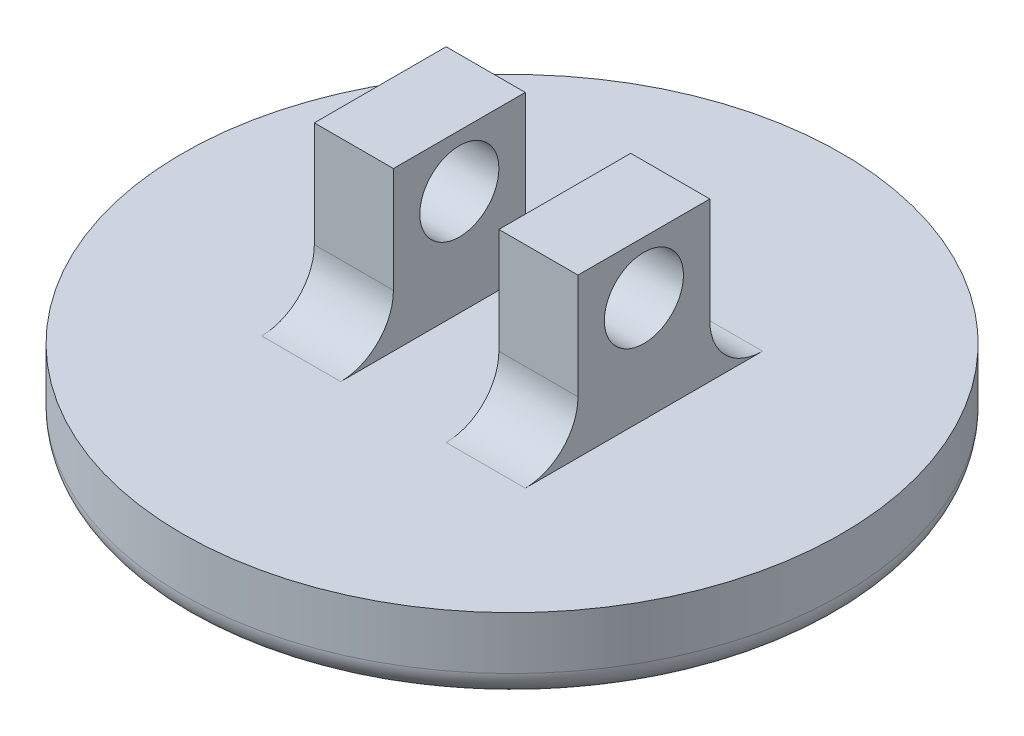
ISO-10303-21;
HEADER;
FILE_DESCRIPTION(('STEP AP214'),'2;1');
FILE_NAME('part.step','',(''),(''),'','','');
FILE_SCHEMA(('AUTOMOTIVE_DESIGN { 1 0 10303 214 1 1 1 1 }'));
ENDSEC;
DATA;
#1=APPLICATION_CONTEXT('core data for automotive mechanical design processes');
#2=APPLICATION_PROTOCOL_DEFINITION('international standard','automotive_design',2000,#1);
#3=PRODUCT_CONTEXT('',#1,'mechanical');
#4=PRODUCT('Part','Part','',(#3));
#5=PRODUCT_RELATED_PRODUCT_CATEGORY('part','',(#4));
#6=PRODUCT_DEFINITION_FORMATION('','',#4);
#7=PRODUCT_DEFINITION_CONTEXT('part definition',#1,'design');
#8=PRODUCT_DEFINITION('design','',#6,#7);
#9=PRODUCT_DEFINITION_SHAPE('','',#8);
#10=(LENGTH_UNIT() NAMED_UNIT(*) SI_UNIT(.MILLI.,.METRE.));
#11=(NAMED_UNIT(*) PLANE_ANGLE_UNIT() SI_UNIT($,.RADIAN.));
#12=(NAMED_UNIT(*) SI_UNIT($,.STERADIAN.) SOLID_ANGLE_UNIT());
#13=UNCERTAINTY_MEASURE_WITH_UNIT(LENGTH_MEASURE(1.E-05),#10,'distance_accuracy_value','');
#14=(GEOMETRIC_REPRESENTATION_CONTEXT(3) GLOBAL_UNCERTAINTY_ASSIGNED_CONTEXT((#13)) GLOBAL_UNIT_ASSIGNED_CONTEXT((#10,
#11,#12)) REPRESENTATION_CONTEXT('',''));
#15=CARTESIAN_POINT('',(0.,0.,0.));
#16=DIRECTION('',(0.,0.,1.));
#17=DIRECTION('',(1.,0.,0.));
#18=AXIS2_PLACEMENT_3D('',#15,#16,#17);
#19=CARTESIAN_POINT('',(0.,3.,0.));
#20=DIRECTION('',(0.,1.,0.));
#21=DIRECTION('',(0.,0.,1.));
#22=AXIS2_PLACEMENT_3D('',#19,#20,#21);
#23=PLANE('',#22);
#24=CARTESIAN_POINT('',(0.,3.,0.));
#25=DIRECTION('',(0.,1.,0.));
#26=DIRECTION('',(0.,0.,1.));
#27=AXIS2_PLACEMENT_3D('',#24,#25,#26);
#28=CIRCLE('',#27,12.5);
#29=CARTESIAN_POINT('',(0.,3.,12.5));
#30=VERTEX_POINT('',#29);
#31=EDGE_CURVE('E181',#30,#30,#28,.T.);
#32=ORIENTED_EDGE('',*,*,#31,.T.);
#33=EDGE_LOOP('',(#32));
#34=FACE_BOUND('',#33,.T.);
#35=DIRECTION('',(0.,0.,-1.));
#36=VECTOR('',#35,1.);
#37=CARTESIAN_POINT('',(-2.,3.,-2.5));
#38=LINE('',#37,#36);
#39=CARTESIAN_POINT('',(-2.,3.,4.5));
#40=VERTEX_POINT('',#39);
#41=CARTESIAN_POINT('',(-2.,3.,-4.5));
#42=VERTEX_POINT('',#41);
#43=EDGE_CURVE('E151',#40,#42,#38,.T.);
#44=ORIENTED_EDGE('',*,*,#43,.F.);
#45=DIRECTION('',(1.,0.,0.));
#46=VECTOR('',#45,1.);
#47=CARTESIAN_POINT('',(0.,3.,4.5));
#48=LINE('',#47,#46);
#49=CARTESIAN_POINT('',(-5.,3.,4.5));
#50=VERTEX_POINT('',#49);
#51=EDGE_CURVE('E200',#40,#50,#48,.F.);
#52=ORIENTED_EDGE('',*,*,#51,.T.);
#53=DIRECTION('',(0.,0.,1.));
#54=VECTOR('',#53,1.);
#55=CARTESIAN_POINT('',(-5.,3.,-2.5));
#56=LINE('',#55,#54);
#57=CARTESIAN_POINT('',(-5.,3.,-4.5));
#58=VERTEX_POINT('',#57);
#59=EDGE_CURVE('E153',#58,#50,#56,.T.);
#60=ORIENTED_EDGE('',*,*,#59,.F.);
#61=DIRECTION('',(-1.,0.,0.));
#62=VECTOR('',#61,1.);
#63=CARTESIAN_POINT('',(0.,3.,-4.5));
#64=LINE('',#63,#62);
#65=EDGE_CURVE('E197',#58,#42,#64,.F.);
#66=ORIENTED_EDGE('',*,*,#65,.T.);
#67=EDGE_LOOP('',(#44,#52,#60,#66));
#68=FACE_BOUND('',#67,.T.);
#69=DIRECTION('',(0.,0.,1.));
#70=VECTOR('',#69,1.);
#71=CARTESIAN_POINT('',(2.,3.,-2.5));
#72=LINE('',#71,#70);
#73=CARTESIAN_POINT('',(2.,3.,-4.5));
#74=VERTEX_POINT('',#73);
#75=CARTESIAN_POINT('',(2.,3.,4.5));
#76=VERTEX_POINT('',#75);
#77=EDGE_CURVE('E146',#74,#76,#72,.T.);
#78=ORIENTED_EDGE('',*,*,#77,.F.);
#79=DIRECTION('',(-1.,0.,0.));
#80=VECTOR('',#79,1.);
#81=CARTESIAN_POINT('',(0.,3.,-4.5));
#82=LINE('',#81,#80);
#83=CARTESIAN_POINT('',(5.,3.,-4.5));
#84=VERTEX_POINT('',#83);
#85=EDGE_CURVE('E194',#74,#84,#82,.F.);
#86=ORIENTED_EDGE('',*,*,#85,.T.);
#87=DIRECTION('',(0.,0.,-1.));
#88=VECTOR('',#87,1.);
#89=CARTESIAN_POINT('',(5.,3.,-2.5));
#90=LINE('',#89,#88);
#91=CARTESIAN_POINT('',(5.,3.,4.5));
#92=VERTEX_POINT('',#91);
#93=EDGE_CURVE('E274',#92,#84,#90,.T.);
#94=ORIENTED_EDGE('',*,*,#93,.F.);
#95=DIRECTION('',(1.,0.,0.));
#96=VECTOR('',#95,1.);
#97=CARTESIAN_POINT('',(0.,3.,4.5));
#98=LINE('',#97,#96);
#99=EDGE_CURVE('E191',#92,#76,#98,.F.);
#100=ORIENTED_EDGE('',*,*,#99,.T.);
#101=EDGE_LOOP('',(#78,#86,#94,#100));
#102=FACE_BOUND('',#101,.T.);
#103=ADVANCED_FACE('F33',(#34,#68,#102),#23,.T.);
#104=CARTESIAN_POINT('',(0.,3.,0.));
#105=DIRECTION('',(0.,-1.,0.));
#106=DIRECTION('',(0.,0.,-1.));
#107=AXIS2_PLACEMENT_3D('',#104,#105,#106);
#108=CYLINDRICAL_SURFACE('',#107,12.5);
#109=CARTESIAN_POINT('',(0.,1.,0.));
#110=DIRECTION('',(0.,1.,0.));
#111=DIRECTION('',(0.,0.,1.));
#112=AXIS2_PLACEMENT_3D('',#109,#110,#111);
#113=CIRCLE('',#112,12.5);
#114=CARTESIAN_POINT('',(0.,1.,12.5));
#115=VERTEX_POINT('',#114);
#116=EDGE_CURVE('E41',#115,#115,#113,.T.);
#117=ORIENTED_EDGE('',*,*,#116,.T.);
#118=EDGE_LOOP('',(#117));
#119=FACE_BOUND('',#118,.T.);
#120=ORIENTED_EDGE('',*,*,#31,.F.);
#121=EDGE_LOOP('',(#120));
#122=FACE_BOUND('',#121,.T.);
#123=ADVANCED_FACE('F228',(#119,#122),#108,.T.);
#124=CARTESIAN_POINT('',(0.,0.,0.));
#125=DIRECTION('',(0.,1.,0.));
#126=DIRECTION('',(0.,0.,1.));
#127=AXIS2_PLACEMENT_3D('',#124,#125,#126);
#128=PLANE('',#127);
#129=CARTESIAN_POINT('',(0.,0.,0.));
#130=DIRECTION('',(0.,1.,0.));
#131=DIRECTION('',(0.,0.,1.));
#132=AXIS2_PLACEMENT_3D('',#129,#130,#131);
#133=CIRCLE('',#132,11.5);
#134=CARTESIAN_POINT('',(0.,0.,11.5));
#135=VERTEX_POINT('',#134);
#136=EDGE_CURVE('E11',#135,#135,#133,.F.);
#137=ORIENTED_EDGE('',*,*,#136,.T.);
#138=EDGE_LOOP('',(#137));
#139=FACE_BOUND('',#138,.T.);
#140=ADVANCED_FACE('F245',(#139),#128,.F.);
#141=CARTESIAN_POINT('',(-2.,9.,-2.5));
#142=DIRECTION('',(-1.,0.,0.));
#143=DIRECTION('',(0.,0.,1.));
#144=AXIS2_PLACEMENT_3D('',#141,#142,#143);
#145=PLANE('',#144);
#146=CARTESIAN_POINT('',(-2.,7.,0.));
#147=DIRECTION('',(-1.,0.,0.));
#148=DIRECTION('',(0.,0.,1.));
#149=AXIS2_PLACEMENT_3D('',#146,#147,#148);
#150=CIRCLE('',#149,1.5);
#151=CARTESIAN_POINT('',(-2.,7.,1.5));
#152=VERTEX_POINT('',#151);
#153=EDGE_CURVE('E276',#152,#152,#150,.T.);
#154=ORIENTED_EDGE('',*,*,#153,.T.);
#155=EDGE_LOOP('',(#154));
#156=FACE_BOUND('',#155,.T.);
#157=ORIENTED_EDGE('',*,*,#43,.T.);
#158=CARTESIAN_POINT('',(-2.,5.,-4.5));
#159=DIRECTION('',(-1.,0.,0.));
#160=DIRECTION('',(0.,0.,1.));
#161=AXIS2_PLACEMENT_3D('',#158,#159,#160);
#162=CIRCLE('',#161,2.);
#163=CARTESIAN_POINT('',(-2.,5.,-2.5));
#164=VERTEX_POINT('',#163);
#165=EDGE_CURVE('E218',#42,#164,#162,.T.);
#166=ORIENTED_EDGE('',*,*,#165,.T.);
#167=DIRECTION('',(0.,-1.,0.));
#168=VECTOR('',#167,1.);
#169=CARTESIAN_POINT('',(-2.,9.,-2.5));
#170=LINE('',#169,#168);
#171=CARTESIAN_POINT('',(-2.,9.,-2.5));
#172=VERTEX_POINT('',#171);
#173=EDGE_CURVE('E178',#172,#164,#170,.T.);
#174=ORIENTED_EDGE('',*,*,#173,.F.);
#175=DIRECTION('',(0.,0.,-1.));
#176=VECTOR('',#175,1.);
#177=CARTESIAN_POINT('',(-2.,9.,-2.5));
#178=LINE('',#177,#176);
#179=CARTESIAN_POINT('',(-2.,9.,2.5));
#180=VERTEX_POINT('',#179);
#181=EDGE_CURVE('E159',#180,#172,#178,.T.);
#182=ORIENTED_EDGE('',*,*,#181,.F.);
#183=DIRECTION('',(0.,-1.,0.));
#184=VECTOR('',#183,1.);
#185=CARTESIAN_POINT('',(-2.,9.,2.5));
#186=LINE('',#185,#184);
#187=CARTESIAN_POINT('',(-2.,5.,2.5));
#188=VERTEX_POINT('',#187);
#189=EDGE_CURVE('E167',#180,#188,#186,.T.);
#190=ORIENTED_EDGE('',*,*,#189,.T.);
#191=CARTESIAN_POINT('',(-2.,5.,4.5));
#192=DIRECTION('',(-1.,0.,0.));
#193=DIRECTION('',(0.,0.,1.));
#194=AXIS2_PLACEMENT_3D('',#191,#192,#193);
#195=CIRCLE('',#194,2.);
#196=EDGE_CURVE('E210',#188,#40,#195,.T.);
#197=ORIENTED_EDGE('',*,*,#196,.T.);
#198=EDGE_LOOP('',(#157,#166,#174,#182,#190,#197));
#199=FACE_BOUND('',#198,.T.);
#200=ADVANCED_FACE('F250',(#156,#199),#145,.F.);
#201=CARTESIAN_POINT('',(-5.,9.,-2.5));
#202=DIRECTION('',(0.,0.,1.));
#203=DIRECTION('',(1.,0.,0.));
#204=AXIS2_PLACEMENT_3D('',#201,#202,#203);
#205=PLANE('',#204);
#206=ORIENTED_EDGE('',*,*,#173,.T.);
#207=DIRECTION('',(-1.,0.,0.));
#208=VECTOR('',#207,1.);
#209=CARTESIAN_POINT('',(-5.,5.,-2.5));
#210=LINE('',#209,#208);
#211=CARTESIAN_POINT('',(-5.,5.,-2.5));
#212=VERTEX_POINT('',#211);
#213=EDGE_CURVE('E203',#164,#212,#210,.T.);
#214=ORIENTED_EDGE('',*,*,#213,.T.);
#215=DIRECTION('',(0.,-1.,0.));
#216=VECTOR('',#215,1.);
#217=CARTESIAN_POINT('',(-5.,9.,-2.5));
#218=LINE('',#217,#216);
#219=CARTESIAN_POINT('',(-5.,9.,-2.5));
#220=VERTEX_POINT('',#219);
#221=EDGE_CURVE('E175',#220,#212,#218,.T.);
#222=ORIENTED_EDGE('',*,*,#221,.F.);
#223=DIRECTION('',(-1.,0.,0.));
#224=VECTOR('',#223,1.);
#225=CARTESIAN_POINT('',(-5.,9.,-2.5));
#226=LINE('',#225,#224);
#227=EDGE_CURVE('E162',#172,#220,#226,.T.);
#228=ORIENTED_EDGE('',*,*,#227,.F.);
#229=EDGE_LOOP('',(#206,#214,#222,#228));
#230=FACE_BOUND('',#229,.T.);
#231=ADVANCED_FACE('F308',(#230),#205,.F.);
#232=CARTESIAN_POINT('',(-5.,9.,-2.5));
#233=DIRECTION('',(1.,0.,0.));
#234=DIRECTION('',(0.,0.,-1.));
#235=AXIS2_PLACEMENT_3D('',#232,#233,#234);
#236=PLANE('',#235);
#237=CARTESIAN_POINT('',(-5.,7.,0.));
#238=DIRECTION('',(1.,0.,0.));
#239=DIRECTION('',(0.,0.,-1.));
#240=AXIS2_PLACEMENT_3D('',#237,#238,#239);
#241=CIRCLE('',#240,1.5);
#242=CARTESIAN_POINT('',(-5.,7.,-1.5));
#243=VERTEX_POINT('',#242);
#244=EDGE_CURVE('E336',#243,#243,#241,.T.);
#245=ORIENTED_EDGE('',*,*,#244,.T.);
#246=EDGE_LOOP('',(#245));
#247=FACE_BOUND('',#246,.T.);
#248=ORIENTED_EDGE('',*,*,#59,.T.);
#249=CARTESIAN_POINT('',(-5.,5.,4.5));
#250=DIRECTION('',(1.,0.,0.));
#251=DIRECTION('',(0.,0.,-1.));
#252=AXIS2_PLACEMENT_3D('',#249,#250,#251);
#253=CIRCLE('',#252,2.);
#254=CARTESIAN_POINT('',(-5.,5.,2.5));
#255=VERTEX_POINT('',#254);
#256=EDGE_CURVE('E213',#50,#255,#253,.T.);
#257=ORIENTED_EDGE('',*,*,#256,.T.);
#258=DIRECTION('',(0.,-1.,0.));
#259=VECTOR('',#258,1.);
#260=CARTESIAN_POINT('',(-5.,9.,2.5));
#261=LINE('',#260,#259);
#262=CARTESIAN_POINT('',(-5.,9.,2.5));
#263=VERTEX_POINT('',#262);
#264=EDGE_CURVE('E172',#263,#255,#261,.T.);
#265=ORIENTED_EDGE('',*,*,#264,.F.);
#266=DIRECTION('',(0.,0.,1.));
#267=VECTOR('',#266,1.);
#268=CARTESIAN_POINT('',(-5.,9.,-2.5));
#269=LINE('',#268,#267);
#270=EDGE_CURVE('E164',#220,#263,#269,.T.);
#271=ORIENTED_EDGE('',*,*,#270,.F.);
#272=ORIENTED_EDGE('',*,*,#221,.T.);
#273=CARTESIAN_POINT('',(-5.,5.,-4.5));
#274=DIRECTION('',(1.,0.,0.));
#275=DIRECTION('',(0.,0.,-1.));
#276=AXIS2_PLACEMENT_3D('',#273,#274,#275);
#277=CIRCLE('',#276,2.);
#278=EDGE_CURVE('E215',#212,#58,#277,.T.);
#279=ORIENTED_EDGE('',*,*,#278,.T.);
#280=EDGE_LOOP('',(#248,#257,#265,#271,#272,#279));
#281=FACE_BOUND('',#280,.T.);
#282=ADVANCED_FACE('F305',(#247,#281),#236,.F.);
#283=CARTESIAN_POINT('',(-5.,9.,2.5));
#284=DIRECTION('',(0.,0.,-1.));
#285=DIRECTION('',(-1.,0.,0.));
#286=AXIS2_PLACEMENT_3D('',#283,#284,#285);
#287=PLANE('',#286);
#288=ORIENTED_EDGE('',*,*,#264,.T.);
#289=DIRECTION('',(1.,0.,0.));
#290=VECTOR('',#289,1.);
#291=CARTESIAN_POINT('',(-5.,5.,2.5));
#292=LINE('',#291,#290);
#293=EDGE_CURVE('E184',#255,#188,#292,.T.);
#294=ORIENTED_EDGE('',*,*,#293,.T.);
#295=ORIENTED_EDGE('',*,*,#189,.F.);
#296=DIRECTION('',(1.,0.,0.));
#297=VECTOR('',#296,1.);
#298=CARTESIAN_POINT('',(-5.,9.,2.5));
#299=LINE('',#298,#297);
#300=EDGE_CURVE('E166',#263,#180,#299,.T.);
#301=ORIENTED_EDGE('',*,*,#300,.F.);
#302=EDGE_LOOP('',(#288,#294,#295,#301));
#303=FACE_BOUND('',#302,.T.);
#304=ADVANCED_FACE('F301',(#303),#287,.F.);
#305=CARTESIAN_POINT('',(0.,9.,0.));
#306=DIRECTION('',(0.,1.,0.));
#307=DIRECTION('',(0.,0.,1.));
#308=AXIS2_PLACEMENT_3D('',#305,#306,#307);
#309=PLANE('',#308);
#310=ORIENTED_EDGE('',*,*,#181,.T.);
#311=ORIENTED_EDGE('',*,*,#227,.T.);
#312=ORIENTED_EDGE('',*,*,#270,.T.);
#313=ORIENTED_EDGE('',*,*,#300,.T.);
#314=EDGE_LOOP('',(#310,#311,#312,#313));
#315=FACE_BOUND('',#314,.T.);
#316=ADVANCED_FACE('F297',(#315),#309,.T.);
#317=CARTESIAN_POINT('',(5.,9.,-2.5));
#318=DIRECTION('',(-1.,0.,0.));
#319=DIRECTION('',(0.,0.,1.));
#320=AXIS2_PLACEMENT_3D('',#317,#318,#319);
#321=PLANE('',#320);
#322=CARTESIAN_POINT('',(5.,7.,0.));
#323=DIRECTION('',(-1.,0.,0.));
#324=DIRECTION('',(0.,0.,1.));
#325=AXIS2_PLACEMENT_3D('',#322,#323,#324);
#326=CIRCLE('',#325,1.5);
#327=CARTESIAN_POINT('',(5.,7.,1.5));
#328=VERTEX_POINT('',#327);
#329=EDGE_CURVE('E188',#328,#328,#326,.T.);
#330=ORIENTED_EDGE('',*,*,#329,.T.);
#331=EDGE_LOOP('',(#330));
#332=FACE_BOUND('',#331,.T.);
#333=ORIENTED_EDGE('',*,*,#93,.T.);
#334=CARTESIAN_POINT('',(5.,5.,-4.5));
#335=DIRECTION('',(-1.,0.,0.));
#336=DIRECTION('',(0.,0.,1.));
#337=AXIS2_PLACEMENT_3D('',#334,#335,#336);
#338=CIRCLE('',#337,2.);
#339=CARTESIAN_POINT('',(5.,5.,-2.5));
#340=VERTEX_POINT('',#339);
#341=EDGE_CURVE('E150',#84,#340,#338,.T.);
#342=ORIENTED_EDGE('',*,*,#341,.T.);
#343=DIRECTION('',(0.,-1.,0.));
#344=VECTOR('',#343,1.);
#345=CARTESIAN_POINT('',(5.,9.,-2.5));
#346=LINE('',#345,#344);
#347=CARTESIAN_POINT('',(5.,9.,-2.5));
#348=VERTEX_POINT('',#347);
#349=EDGE_CURVE('E130',#348,#340,#346,.T.);
#350=ORIENTED_EDGE('',*,*,#349,.F.);
#351=DIRECTION('',(0.,0.,-1.));
#352=VECTOR('',#351,1.);
#353=CARTESIAN_POINT('',(5.,9.,-2.5));
#354=LINE('',#353,#352);
#355=CARTESIAN_POINT('',(5.,9.,2.5));
#356=VERTEX_POINT('',#355);
#357=EDGE_CURVE('E137',#356,#348,#354,.T.);
#358=ORIENTED_EDGE('',*,*,#357,.F.);
#359=DIRECTION('',(0.,-1.,0.));
#360=VECTOR('',#359,1.);
#361=CARTESIAN_POINT('',(5.,9.,2.5));
#362=LINE('',#361,#360);
#363=CARTESIAN_POINT('',(5.,5.,2.5));
#364=VERTEX_POINT('',#363);
#365=EDGE_CURVE('E271',#356,#364,#362,.T.);
#366=ORIENTED_EDGE('',*,*,#365,.T.);
#367=CARTESIAN_POINT('',(5.,5.,4.5));
#368=DIRECTION('',(-1.,0.,0.));
#369=DIRECTION('',(0.,0.,1.));
#370=AXIS2_PLACEMENT_3D('',#367,#368,#369);
#371=CIRCLE('',#370,2.);
#372=EDGE_CURVE('E56',#364,#92,#371,.T.);
#373=ORIENTED_EDGE('',*,*,#372,.T.);
#374=EDGE_LOOP('',(#333,#342,#350,#358,#366,#373));
#375=FACE_BOUND('',#374,.T.);
#376=ADVANCED_FACE('F148',(#332,#375),#321,.F.);
#377=CARTESIAN_POINT('',(2.,9.,-2.5));
#378=DIRECTION('',(0.,0.,1.));
#379=DIRECTION('',(1.,0.,0.));
#380=AXIS2_PLACEMENT_3D('',#377,#378,#379);
#381=PLANE('',#380);
#382=ORIENTED_EDGE('',*,*,#349,.T.);
#383=DIRECTION('',(-1.,0.,0.));
#384=VECTOR('',#383,1.);
#385=CARTESIAN_POINT('',(2.,5.,-2.5));
#386=LINE('',#385,#384);
#387=CARTESIAN_POINT('',(2.,5.,-2.5));
#388=VERTEX_POINT('',#387);
#389=EDGE_CURVE('E206',#340,#388,#386,.T.);
#390=ORIENTED_EDGE('',*,*,#389,.T.);
#391=DIRECTION('',(0.,-1.,0.));
#392=VECTOR('',#391,1.);
#393=CARTESIAN_POINT('',(2.,9.,-2.5));
#394=LINE('',#393,#392);
#395=CARTESIAN_POINT('',(2.,9.,-2.5));
#396=VERTEX_POINT('',#395);
#397=EDGE_CURVE('E133',#396,#388,#394,.T.);
#398=ORIENTED_EDGE('',*,*,#397,.F.);
#399=DIRECTION('',(-1.,0.,0.));
#400=VECTOR('',#399,1.);
#401=CARTESIAN_POINT('',(2.,9.,-2.5));
#402=LINE('',#401,#400);
#403=EDGE_CURVE('E125',#348,#396,#402,.T.);
#404=ORIENTED_EDGE('',*,*,#403,.F.);
#405=EDGE_LOOP('',(#382,#390,#398,#404));
#406=FACE_BOUND('',#405,.T.);
#407=ADVANCED_FACE('F127',(#406),#381,.F.);
#408=CARTESIAN_POINT('',(2.,9.,-2.5));
#409=DIRECTION('',(1.,0.,0.));
#410=DIRECTION('',(0.,0.,-1.));
#411=AXIS2_PLACEMENT_3D('',#408,#409,#410);
#412=PLANE('',#411);
#413=CARTESIAN_POINT('',(2.,7.,0.));
#414=DIRECTION('',(1.,0.,0.));
#415=DIRECTION('',(0.,0.,-1.));
#416=AXIS2_PLACEMENT_3D('',#413,#414,#415);
#417=CIRCLE('',#416,1.5);
#418=CARTESIAN_POINT('',(2.,7.,-1.5));
#419=VERTEX_POINT('',#418);
#420=EDGE_CURVE('E185',#419,#419,#417,.T.);
#421=ORIENTED_EDGE('',*,*,#420,.T.);
#422=EDGE_LOOP('',(#421));
#423=FACE_BOUND('',#422,.T.);
#424=ORIENTED_EDGE('',*,*,#77,.T.);
#425=CARTESIAN_POINT('',(2.,5.,4.5));
#426=DIRECTION('',(1.,0.,0.));
#427=DIRECTION('',(0.,0.,-1.));
#428=AXIS2_PLACEMENT_3D('',#425,#426,#427);
#429=CIRCLE('',#428,2.);
#430=CARTESIAN_POINT('',(2.,5.,2.5));
#431=VERTEX_POINT('',#430);
#432=EDGE_CURVE('E48',#76,#431,#429,.T.);
#433=ORIENTED_EDGE('',*,*,#432,.T.);
#434=DIRECTION('',(0.,-1.,0.));
#435=VECTOR('',#434,1.);
#436=CARTESIAN_POINT('',(2.,9.,2.5));
#437=LINE('',#436,#435);
#438=CARTESIAN_POINT('',(2.,9.,2.5));
#439=VERTEX_POINT('',#438);
#440=EDGE_CURVE('E155',#439,#431,#437,.T.);
#441=ORIENTED_EDGE('',*,*,#440,.F.);
#442=DIRECTION('',(0.,0.,1.));
#443=VECTOR('',#442,1.);
#444=CARTESIAN_POINT('',(2.,9.,-2.5));
#445=LINE('',#444,#443);
#446=EDGE_CURVE('E136',#396,#439,#445,.T.);
#447=ORIENTED_EDGE('',*,*,#446,.F.);
#448=ORIENTED_EDGE('',*,*,#397,.T.);
#449=CARTESIAN_POINT('',(2.,5.,-4.5));
#450=DIRECTION('',(1.,0.,0.));
#451=DIRECTION('',(0.,0.,-1.));
#452=AXIS2_PLACEMENT_3D('',#449,#450,#451);
#453=CIRCLE('',#452,2.);
#454=EDGE_CURVE('E220',#388,#74,#453,.T.);
#455=ORIENTED_EDGE('',*,*,#454,.T.);
#456=EDGE_LOOP('',(#424,#433,#441,#447,#448,#455));
#457=FACE_BOUND('',#456,.T.);
#458=ADVANCED_FACE('F269',(#423,#457),#412,.F.);
#459=CARTESIAN_POINT('',(2.,9.,2.5));
#460=DIRECTION('',(0.,0.,-1.));
#461=DIRECTION('',(-1.,0.,0.));
#462=AXIS2_PLACEMENT_3D('',#459,#460,#461);
#463=PLANE('',#462);
#464=ORIENTED_EDGE('',*,*,#440,.T.);
#465=DIRECTION('',(1.,0.,0.));
#466=VECTOR('',#465,1.);
#467=CARTESIAN_POINT('',(2.,5.,2.5));
#468=LINE('',#467,#466);
#469=EDGE_CURVE('E208',#431,#364,#468,.T.);
#470=ORIENTED_EDGE('',*,*,#469,.T.);
#471=ORIENTED_EDGE('',*,*,#365,.F.);
#472=DIRECTION('',(1.,0.,0.));
#473=VECTOR('',#472,1.);
#474=CARTESIAN_POINT('',(2.,9.,2.5));
#475=LINE('',#474,#473);
#476=EDGE_CURVE('E142',#439,#356,#475,.T.);
#477=ORIENTED_EDGE('',*,*,#476,.F.);
#478=EDGE_LOOP('',(#464,#470,#471,#477));
#479=FACE_BOUND('',#478,.T.);
#480=ADVANCED_FACE('F279',(#479),#463,.F.);
#481=CARTESIAN_POINT('',(0.,9.,0.));
#482=DIRECTION('',(0.,1.,0.));
#483=DIRECTION('',(0.,0.,1.));
#484=AXIS2_PLACEMENT_3D('',#481,#482,#483);
#485=PLANE('',#484);
#486=ORIENTED_EDGE('',*,*,#357,.T.);
#487=ORIENTED_EDGE('',*,*,#403,.T.);
#488=ORIENTED_EDGE('',*,*,#446,.T.);
#489=ORIENTED_EDGE('',*,*,#476,.T.);
#490=EDGE_LOOP('',(#486,#487,#488,#489));
#491=FACE_BOUND('',#490,.T.);
#492=ADVANCED_FACE('F140',(#491),#485,.T.);
#493=CARTESIAN_POINT('',(-12.5,7.,0.));
#494=DIRECTION('',(1.,0.,0.));
#495=DIRECTION('',(0.,0.,-1.));
#496=AXIS2_PLACEMENT_3D('',#493,#494,#495);
#497=CYLINDRICAL_SURFACE('',#496,1.5);
#498=ORIENTED_EDGE('',*,*,#420,.F.);
#499=EDGE_LOOP('',(#498));
#500=FACE_BOUND('',#499,.T.);
#501=ORIENTED_EDGE('',*,*,#329,.F.);
#502=EDGE_LOOP('',(#501));
#503=FACE_BOUND('',#502,.T.);
#504=ADVANCED_FACE('F287',(#500,#503),#497,.F.);
#505=ORIENTED_EDGE('',*,*,#244,.F.);
#506=EDGE_LOOP('',(#505));
#507=FACE_BOUND('',#506,.T.);
#508=ORIENTED_EDGE('',*,*,#153,.F.);
#509=EDGE_LOOP('',(#508));
#510=FACE_BOUND('',#509,.T.);
#511=ADVANCED_FACE('F259',(#507,#510),#497,.F.);
#512=CARTESIAN_POINT('',(-5.,5.,4.5));
#513=DIRECTION('',(1.,0.,0.));
#514=DIRECTION('',(0.,0.,-1.));
#515=AXIS2_PLACEMENT_3D('',#512,#513,#514);
#516=CYLINDRICAL_SURFACE('',#515,2.);
#517=ORIENTED_EDGE('',*,*,#256,.F.);
#518=ORIENTED_EDGE('',*,*,#51,.F.);
#519=ORIENTED_EDGE('',*,*,#196,.F.);
#520=ORIENTED_EDGE('',*,*,#293,.F.);
#521=EDGE_LOOP('',(#517,#518,#519,#520));
#522=FACE_BOUND('',#521,.T.);
#523=ADVANCED_FACE('F255',(#522),#516,.F.);
#524=CARTESIAN_POINT('',(-5.,5.,-4.5));
#525=DIRECTION('',(-1.,0.,0.));
#526=DIRECTION('',(0.,0.,1.));
#527=AXIS2_PLACEMENT_3D('',#524,#525,#526);
#528=CYLINDRICAL_SURFACE('',#527,2.);
#529=ORIENTED_EDGE('',*,*,#165,.F.);
#530=ORIENTED_EDGE('',*,*,#65,.F.);
#531=ORIENTED_EDGE('',*,*,#278,.F.);
#532=ORIENTED_EDGE('',*,*,#213,.F.);
#533=EDGE_LOOP('',(#529,#530,#531,#532));
#534=FACE_BOUND('',#533,.T.);
#535=ADVANCED_FACE('F258',(#534),#528,.F.);
#536=CARTESIAN_POINT('',(2.,5.,-4.5));
#537=DIRECTION('',(-1.,0.,0.));
#538=DIRECTION('',(0.,0.,1.));
#539=AXIS2_PLACEMENT_3D('',#536,#537,#538);
#540=CYLINDRICAL_SURFACE('',#539,2.);
#541=ORIENTED_EDGE('',*,*,#341,.F.);
#542=ORIENTED_EDGE('',*,*,#85,.F.);
#543=ORIENTED_EDGE('',*,*,#454,.F.);
#544=ORIENTED_EDGE('',*,*,#389,.F.);
#545=EDGE_LOOP('',(#541,#542,#543,#544));
#546=FACE_BOUND('',#545,.T.);
#547=ADVANCED_FACE('F237',(#546),#540,.F.);
#548=CARTESIAN_POINT('',(2.,5.,4.5));
#549=DIRECTION('',(1.,0.,0.));
#550=DIRECTION('',(0.,0.,-1.));
#551=AXIS2_PLACEMENT_3D('',#548,#549,#550);
#552=CYLINDRICAL_SURFACE('',#551,2.);
#553=ORIENTED_EDGE('',*,*,#432,.F.);
#554=ORIENTED_EDGE('',*,*,#99,.F.);
#555=ORIENTED_EDGE('',*,*,#372,.F.);
#556=ORIENTED_EDGE('',*,*,#469,.F.);
#557=EDGE_LOOP('',(#553,#554,#555,#556));
#558=FACE_BOUND('',#557,.T.);
#559=ADVANCED_FACE('F232',(#558),#552,.F.);
#560=CARTESIAN_POINT('',(0.,1.,0.));
#561=DIRECTION('',(0.,1.,0.));
#562=DIRECTION('',(0.,0.,1.));
#563=AXIS2_PLACEMENT_3D('',#560,#561,#562);
#564=TOROIDAL_SURFACE('',#563,11.5,1.);
#565=ORIENTED_EDGE('',*,*,#136,.F.);
#566=EDGE_LOOP('',(#565));
#567=FACE_BOUND('',#566,.T.);
#568=ORIENTED_EDGE('',*,*,#116,.F.);
#569=EDGE_LOOP('',(#568));
#570=FACE_BOUND('',#569,.T.);
#571=ADVANCED_FACE('F35',(#567,#570),#564,.T.);
#572=CLOSED_SHELL('',(#103,#123,#140,#200,#231,#282,#304,#316,#376,#407,#458,#480,#492,#504,
#511,#523,#535,#547,#559,#571));
#573=MANIFOLD_SOLID_BREP('B2',#572);
#574=ADVANCED_BREP_SHAPE_REPRESENTATION('',(#18,#573),#14);
#575=SHAPE_DEFINITION_REPRESENTATION(#9,#574);
ENDSEC;
END-ISO-10303-21;
